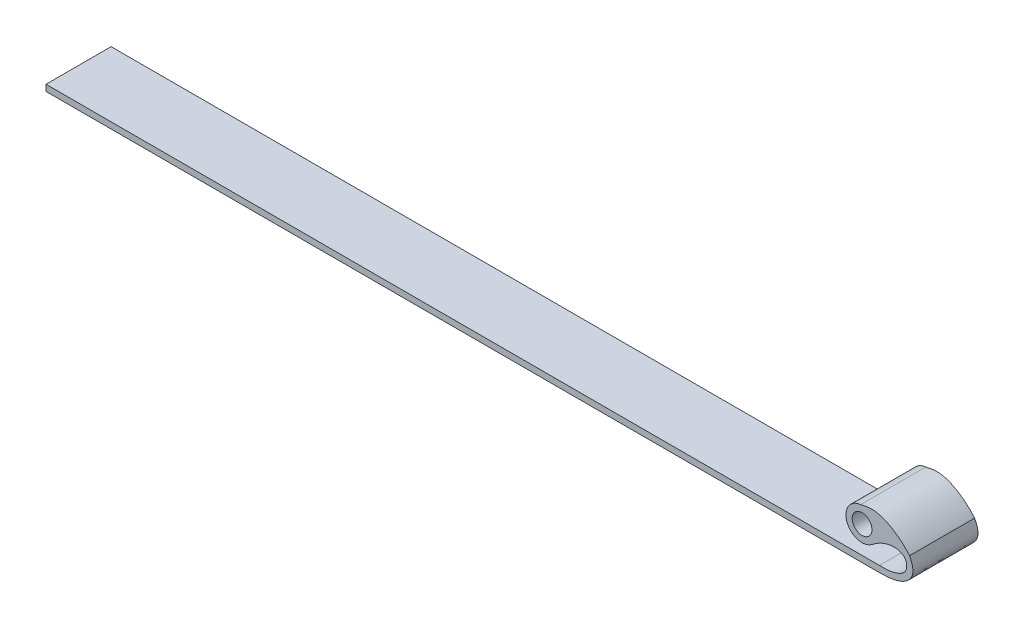
ISO-10303-21;
HEADER;
FILE_DESCRIPTION(('STEP AP214'),'2;1');
FILE_NAME('part.step','',(''),(''),'','','');
FILE_SCHEMA(('AUTOMOTIVE_DESIGN { 1 0 10303 214 1 1 1 1 }'));
ENDSEC;
DATA;
#1=APPLICATION_CONTEXT('core data for automotive mechanical design processes');
#2=APPLICATION_PROTOCOL_DEFINITION('international standard','automotive_design',2000,#1);
#3=PRODUCT_CONTEXT('',#1,'mechanical');
#4=PRODUCT('Part','Part','',(#3));
#5=PRODUCT_RELATED_PRODUCT_CATEGORY('part','',(#4));
#6=PRODUCT_DEFINITION_FORMATION('','',#4);
#7=PRODUCT_DEFINITION_CONTEXT('part definition',#1,'design');
#8=PRODUCT_DEFINITION('design','',#6,#7);
#9=PRODUCT_DEFINITION_SHAPE('','',#8);
#10=(LENGTH_UNIT() NAMED_UNIT(*) SI_UNIT(.MILLI.,.METRE.));
#11=(NAMED_UNIT(*) PLANE_ANGLE_UNIT() SI_UNIT($,.RADIAN.));
#12=(NAMED_UNIT(*) SI_UNIT($,.STERADIAN.) SOLID_ANGLE_UNIT());
#13=UNCERTAINTY_MEASURE_WITH_UNIT(LENGTH_MEASURE(1.E-05),#10,'distance_accuracy_value','');
#14=(GEOMETRIC_REPRESENTATION_CONTEXT(3) GLOBAL_UNCERTAINTY_ASSIGNED_CONTEXT((#13)) GLOBAL_UNIT_ASSIGNED_CONTEXT((#10,
#11,#12)) REPRESENTATION_CONTEXT('',''));
#15=CARTESIAN_POINT('',(0.,0.,0.));
#16=DIRECTION('',(0.,0.,1.));
#17=DIRECTION('',(1.,0.,0.));
#18=AXIS2_PLACEMENT_3D('',#15,#16,#17);
#19=CARTESIAN_POINT('',(-101.6,1.524,-7.9375));
#20=DIRECTION('',(0.,0.,1.));
#21=DIRECTION('',(1.,0.,0.));
#22=AXIS2_PLACEMENT_3D('',#19,#20,#21);
#23=PLANE('',#22);
#24=DIRECTION('',(-1.,0.,0.));
#25=VECTOR('',#24,1.);
#26=CARTESIAN_POINT('',(-101.6,0.,-7.9375));
#27=LINE('',#26,#25);
#28=CARTESIAN_POINT('',(101.6,0.,-7.9375));
#29=VERTEX_POINT('',#28);
#30=CARTESIAN_POINT('',(-101.6,0.,-7.9375));
#31=VERTEX_POINT('',#30);
#32=EDGE_CURVE('E417',#29,#31,#27,.T.);
#33=ORIENTED_EDGE('',*,*,#32,.T.);
#34=DIRECTION('',(0.,-1.,0.));
#35=VECTOR('',#34,1.);
#36=CARTESIAN_POINT('',(-101.6,1.524,-7.9375));
#37=LINE('',#36,#35);
#38=CARTESIAN_POINT('',(-101.6,1.524,-7.9375));
#39=VERTEX_POINT('',#38);
#40=EDGE_CURVE('E13',#39,#31,#37,.T.);
#41=ORIENTED_EDGE('',*,*,#40,.F.);
#42=DIRECTION('',(-1.,0.,0.));
#43=VECTOR('',#42,1.);
#44=CARTESIAN_POINT('',(-101.6,1.524,-7.9375));
#45=LINE('',#44,#43);
#46=CARTESIAN_POINT('',(101.6,1.524,-7.9375));
#47=VERTEX_POINT('',#46);
#48=EDGE_CURVE('E105',#47,#39,#45,.T.);
#49=ORIENTED_EDGE('',*,*,#48,.F.);
#50=CARTESIAN_POINT('',(101.6,1.524,-7.9375));
#51=CARTESIAN_POINT('',(103.2581145174,1.44830625060845,-7.9375));
#52=CARTESIAN_POINT('',(104.638933258889,1.5839468313811,-7.9375));
#53=CARTESIAN_POINT('',(105.766741539468,1.88115494749835,-7.9375));
#54=CARTESIAN_POINT('',(106.652889555584,2.29799250736466,-7.9375));
#55=CARTESIAN_POINT('',(107.304535030096,2.79229628595163,-7.9375));
#56=B_SPLINE_CURVE_WITH_KNOTS('',5,(#50,#51,#52,#53,#54,#55),.UNSPECIFIED.,.F.,.F.,(6,6),(0.,
1.),.UNSPECIFIED.);
#57=CARTESIAN_POINT('',(107.304535030096,2.79229628595163,-7.9375));
#58=VERTEX_POINT('',#57);
#59=EDGE_CURVE('E152',#47,#58,#56,.T.);
#60=ORIENTED_EDGE('',*,*,#59,.T.);
#61=CARTESIAN_POINT('',(105.84624026054,4.71478045105846,-7.9375));
#62=DIRECTION('',(0.,0.,1.));
#63=DIRECTION('',(1.,0.,0.));
#64=AXIS2_PLACEMENT_3D('',#61,#62,#63);
#65=CIRCLE('',#64,2.41299999999999);
#66=CARTESIAN_POINT('',(107.228546137525,6.6926074056864,-7.9375));
#67=VERTEX_POINT('',#66);
#68=EDGE_CURVE('E144',#58,#67,#65,.T.);
#69=ORIENTED_EDGE('',*,*,#68,.T.);
#70=CARTESIAN_POINT('',(107.228546137525,6.69260740568641,-7.9375));
#71=CARTESIAN_POINT('',(106.366027923224,7.18125968031638,-7.9375));
#72=CARTESIAN_POINT('',(105.140033894043,7.42790314041779,-7.9375));
#73=CARTESIAN_POINT('',(103.583408393669,7.28792248516063,-7.9375));
#74=CARTESIAN_POINT('',(101.756786703474,6.57793262541788,-7.9375));
#75=CARTESIAN_POINT('',(99.7863318456045,5.04101505684633,-7.9375));
#76=B_SPLINE_CURVE_WITH_KNOTS('',5,(#70,#71,#72,#73,#74,#75),.UNSPECIFIED.,.F.,.F.,(6,6),(0.,
1.),.UNSPECIFIED.);
#77=CARTESIAN_POINT('',(99.7863318456045,5.04101505684633,-7.9375));
#78=VERTEX_POINT('',#77);
#79=EDGE_CURVE('E149',#67,#78,#76,.T.);
#80=ORIENTED_EDGE('',*,*,#79,.T.);
#81=CARTESIAN_POINT('',(97.3649881124775,8.14537707279204,-7.9375));
#82=DIRECTION('',(0.,0.,1.));
#83=DIRECTION('',(1.,0.,0.));
#84=AXIS2_PLACEMENT_3D('',#81,#82,#83);
#85=CIRCLE('',#84,3.937);
#86=CARTESIAN_POINT('',(96.9956217195011,12.0650119368756,-7.9375));
#87=VERTEX_POINT('',#86);
#88=EDGE_CURVE('E349',#87,#78,#85,.T.);
#89=ORIENTED_EDGE('',*,*,#88,.F.);
#90=CARTESIAN_POINT('',(108.94689031,7.25796652044074,-7.9375));
#91=CARTESIAN_POINT('',(106.455515071137,10.2630081344186,-7.9375));
#92=CARTESIAN_POINT('',(101.235622897515,14.0164041221466,-7.9375));
#93=CARTESIAN_POINT('',(98.5340997550261,12.238404022,-7.9375));
#94=CARTESIAN_POINT('',(96.9956217195011,12.0650119368756,-7.9375));
#95=B_SPLINE_CURVE_WITH_KNOTS('',4,(#90,#91,#92,#93,#94),.UNSPECIFIED.,.F.,.F.,(5,5),(0.,1.),.UNSPECIFIED.);
#96=CARTESIAN_POINT('',(108.94689031,7.25796652044074,-7.9375));
#97=VERTEX_POINT('',#96);
#98=EDGE_CURVE('E339',#97,#87,#95,.T.);
#99=ORIENTED_EDGE('',*,*,#98,.F.);
#100=CARTESIAN_POINT('',(101.6,0.,-7.9375));
#101=CARTESIAN_POINT('',(104.748480566418,-0.00374659124343518,-7.9375));
#102=CARTESIAN_POINT('',(109.050367624,0.25994309898186,-7.9375));
#103=CARTESIAN_POINT('',(110.738003530107,3.23586960295305,-7.9375));
#104=CARTESIAN_POINT('',(109.946934459431,5.04402747878365,-7.9375));
#105=CARTESIAN_POINT('',(108.94689031,7.25796652044074,-7.9375));
#106=B_SPLINE_CURVE_WITH_KNOTS('',5,(#100,#101,#102,#103,#104,#105),.UNSPECIFIED.,.F.,.F.,(6,6),
(0.,1.),.UNSPECIFIED.);
#107=EDGE_CURVE('E329',#29,#97,#106,.T.);
#108=ORIENTED_EDGE('',*,*,#107,.F.);
#109=EDGE_LOOP('',(#33,#41,#49,#60,#69,#80,#89,#99,#108));
#110=FACE_BOUND('',#109,.T.);
#111=CARTESIAN_POINT('',(97.3649881124775,8.14537707279204,-7.9375));
#112=DIRECTION('',(0.,0.,1.));
#113=DIRECTION('',(1.,0.,0.));
#114=AXIS2_PLACEMENT_3D('',#111,#112,#113);
#115=CIRCLE('',#114,2.41299999999999);
#116=CARTESIAN_POINT('',(99.7779881124775,8.14537707279204,-7.9375));
#117=VERTEX_POINT('',#116);
#118=EDGE_CURVE('E168',#117,#117,#115,.T.);
#119=ORIENTED_EDGE('',*,*,#118,.T.);
#120=EDGE_LOOP('',(#119));
#121=FACE_BOUND('',#120,.T.);
#122=ADVANCED_FACE('F52',(#110,#121),#23,.F.);
#123=CARTESIAN_POINT('',(-101.6,1.524,7.9375));
#124=DIRECTION('',(1.,0.,0.));
#125=DIRECTION('',(0.,0.,-1.));
#126=AXIS2_PLACEMENT_3D('',#123,#124,#125);
#127=PLANE('',#126);
#128=DIRECTION('',(0.,0.,1.));
#129=VECTOR('',#128,1.);
#130=CARTESIAN_POINT('',(-101.6,0.,7.9375));
#131=LINE('',#130,#129);
#132=CARTESIAN_POINT('',(-101.6,0.,7.9375));
#133=VERTEX_POINT('',#132);
#134=EDGE_CURVE('E85',#31,#133,#131,.T.);
#135=ORIENTED_EDGE('',*,*,#134,.T.);
#136=DIRECTION('',(0.,-1.,0.));
#137=VECTOR('',#136,1.);
#138=CARTESIAN_POINT('',(-101.6,1.524,7.9375));
#139=LINE('',#138,#137);
#140=CARTESIAN_POINT('',(-101.6,1.524,7.9375));
#141=VERTEX_POINT('',#140);
#142=EDGE_CURVE('E60',#141,#133,#139,.T.);
#143=ORIENTED_EDGE('',*,*,#142,.F.);
#144=DIRECTION('',(0.,0.,1.));
#145=VECTOR('',#144,1.);
#146=CARTESIAN_POINT('',(-101.6,1.524,7.9375));
#147=LINE('',#146,#145);
#148=EDGE_CURVE('E410',#39,#141,#147,.T.);
#149=ORIENTED_EDGE('',*,*,#148,.F.);
#150=ORIENTED_EDGE('',*,*,#40,.T.);
#151=EDGE_LOOP('',(#135,#143,#149,#150));
#152=FACE_BOUND('',#151,.T.);
#153=ADVANCED_FACE('F204',(#152),#127,.F.);
#154=CARTESIAN_POINT('',(-101.6,1.524,7.9375));
#155=DIRECTION('',(0.,0.,-1.));
#156=DIRECTION('',(-1.,0.,0.));
#157=AXIS2_PLACEMENT_3D('',#154,#155,#156);
#158=PLANE('',#157);
#159=DIRECTION('',(1.,0.,0.));
#160=VECTOR('',#159,1.);
#161=CARTESIAN_POINT('',(-101.6,0.,7.9375));
#162=LINE('',#161,#160);
#163=CARTESIAN_POINT('',(101.6,0.,7.9375));
#164=VERTEX_POINT('',#163);
#165=EDGE_CURVE('E95',#133,#164,#162,.T.);
#166=ORIENTED_EDGE('',*,*,#165,.T.);
#167=CARTESIAN_POINT('',(101.6,0.,7.9375));
#168=CARTESIAN_POINT('',(104.748480566418,-0.00374659124343518,7.9375));
#169=CARTESIAN_POINT('',(109.050367624,0.25994309898186,7.9375));
#170=CARTESIAN_POINT('',(110.738003530107,3.23586960295305,7.9375));
#171=CARTESIAN_POINT('',(109.946934459431,5.04402747878365,7.9375));
#172=CARTESIAN_POINT('',(108.94689031,7.25796652044074,7.9375));
#173=B_SPLINE_CURVE_WITH_KNOTS('',5,(#167,#168,#169,#170,#171,#172),.UNSPECIFIED.,.F.,.F.,(6,6),
(0.,1.),.UNSPECIFIED.);
#174=CARTESIAN_POINT('',(108.94689031,7.25796652044074,7.9375));
#175=VERTEX_POINT('',#174);
#176=EDGE_CURVE('E373',#164,#175,#173,.T.);
#177=ORIENTED_EDGE('',*,*,#176,.T.);
#178=CARTESIAN_POINT('',(108.94689031,7.25796652044074,7.9375));
#179=CARTESIAN_POINT('',(106.455515071137,10.2630081344186,7.9375));
#180=CARTESIAN_POINT('',(101.235622897515,14.0164041221466,7.9375));
#181=CARTESIAN_POINT('',(98.5340997550261,12.238404022,7.9375));
#182=CARTESIAN_POINT('',(96.9956217195011,12.0650119368756,7.9375));
#183=B_SPLINE_CURVE_WITH_KNOTS('',4,(#178,#179,#180,#181,#182),.UNSPECIFIED.,.F.,.F.,(5,5),(0.,
1.),.UNSPECIFIED.);
#184=CARTESIAN_POINT('',(96.9956217195011,12.0650119368756,7.9375));
#185=VERTEX_POINT('',#184);
#186=EDGE_CURVE('E381',#175,#185,#183,.T.);
#187=ORIENTED_EDGE('',*,*,#186,.T.);
#188=CARTESIAN_POINT('',(97.3649881124775,8.14537707279204,7.9375));
#189=DIRECTION('',(0.,0.,1.));
#190=DIRECTION('',(1.,0.,0.));
#191=AXIS2_PLACEMENT_3D('',#188,#189,#190);
#192=CIRCLE('',#191,3.937);
#193=CARTESIAN_POINT('',(99.7863318456045,5.04101505684633,7.9375));
#194=VERTEX_POINT('',#193);
#195=EDGE_CURVE('E180',#185,#194,#192,.T.);
#196=ORIENTED_EDGE('',*,*,#195,.T.);
#197=CARTESIAN_POINT('',(107.228546137525,6.69260740568641,7.9375));
#198=CARTESIAN_POINT('',(106.366027923224,7.18125968031638,7.9375));
#199=CARTESIAN_POINT('',(105.140033894043,7.42790314041779,7.9375));
#200=CARTESIAN_POINT('',(103.583408393669,7.28792248516063,7.9375));
#201=CARTESIAN_POINT('',(101.756786703474,6.57793262541788,7.9375));
#202=CARTESIAN_POINT('',(99.7863318456045,5.04101505684633,7.9375));
#203=B_SPLINE_CURVE_WITH_KNOTS('',5,(#197,#198,#199,#200,#201,#202),.UNSPECIFIED.,.F.,.F.,(6,6),
(0.,1.),.UNSPECIFIED.);
#204=CARTESIAN_POINT('',(107.228546137525,6.6926074056864,7.9375));
#205=VERTEX_POINT('',#204);
#206=EDGE_CURVE('E358',#205,#194,#203,.T.);
#207=ORIENTED_EDGE('',*,*,#206,.F.);
#208=CARTESIAN_POINT('',(105.84624026054,4.71478045105846,7.9375));
#209=DIRECTION('',(0.,0.,1.));
#210=DIRECTION('',(1.,0.,0.));
#211=AXIS2_PLACEMENT_3D('',#208,#209,#210);
#212=CIRCLE('',#211,2.41299999999999);
#213=CARTESIAN_POINT('',(107.304535030096,2.79229628595163,7.9375));
#214=VERTEX_POINT('',#213);
#215=EDGE_CURVE('E162',#214,#205,#212,.T.);
#216=ORIENTED_EDGE('',*,*,#215,.F.);
#217=CARTESIAN_POINT('',(101.6,1.524,7.9375));
#218=CARTESIAN_POINT('',(103.2581145174,1.44830625060845,7.9375));
#219=CARTESIAN_POINT('',(104.638933258889,1.5839468313811,7.9375));
#220=CARTESIAN_POINT('',(105.766741539468,1.88115494749835,7.9375));
#221=CARTESIAN_POINT('',(106.652889555584,2.29799250736466,7.9375));
#222=CARTESIAN_POINT('',(107.304535030096,2.79229628595163,7.9375));
#223=B_SPLINE_CURVE_WITH_KNOTS('',5,(#217,#218,#219,#220,#221,#222),.UNSPECIFIED.,.F.,.F.,(6,6),
(0.,1.),.UNSPECIFIED.);
#224=CARTESIAN_POINT('',(101.6,1.524,7.9375));
#225=VERTEX_POINT('',#224);
#226=EDGE_CURVE('E368',#225,#214,#223,.T.);
#227=ORIENTED_EDGE('',*,*,#226,.F.);
#228=DIRECTION('',(1.,0.,0.));
#229=VECTOR('',#228,1.);
#230=CARTESIAN_POINT('',(-101.6,1.524,7.9375));
#231=LINE('',#230,#229);
#232=EDGE_CURVE('E71',#141,#225,#231,.T.);
#233=ORIENTED_EDGE('',*,*,#232,.F.);
#234=ORIENTED_EDGE('',*,*,#142,.T.);
#235=EDGE_LOOP('',(#166,#177,#187,#196,#207,#216,#227,#233,#234));
#236=FACE_BOUND('',#235,.T.);
#237=CARTESIAN_POINT('',(97.3649881124775,8.14537707279204,7.9375));
#238=DIRECTION('',(0.,0.,1.));
#239=DIRECTION('',(1.,0.,0.));
#240=AXIS2_PLACEMENT_3D('',#237,#238,#239);
#241=CIRCLE('',#240,2.41299999999999);
#242=CARTESIAN_POINT('',(99.7779881124775,8.14537707279204,7.9375));
#243=VERTEX_POINT('',#242);
#244=EDGE_CURVE('E174',#243,#243,#241,.T.);
#245=ORIENTED_EDGE('',*,*,#244,.F.);
#246=EDGE_LOOP('',(#245));
#247=FACE_BOUND('',#246,.T.);
#248=ADVANCED_FACE('F199',(#236,#247),#158,.F.);
#249=CARTESIAN_POINT('',(0.,1.524,0.));
#250=DIRECTION('',(0.,-1.,0.));
#251=DIRECTION('',(0.,0.,-1.));
#252=AXIS2_PLACEMENT_3D('',#249,#250,#251);
#253=PLANE('',#252);
#254=DIRECTION('',(0.,0.,-1.));
#255=VECTOR('',#254,1.);
#256=CARTESIAN_POINT('',(101.6,1.524,7.9375));
#257=LINE('',#256,#255);
#258=EDGE_CURVE('E406',#225,#47,#257,.T.);
#259=ORIENTED_EDGE('',*,*,#258,.T.);
#260=ORIENTED_EDGE('',*,*,#48,.T.);
#261=ORIENTED_EDGE('',*,*,#148,.T.);
#262=ORIENTED_EDGE('',*,*,#232,.T.);
#263=EDGE_LOOP('',(#259,#260,#261,#262));
#264=FACE_BOUND('',#263,.T.);
#265=ADVANCED_FACE('F196',(#264),#253,.F.);
#266=CARTESIAN_POINT('',(0.,0.,0.));
#267=DIRECTION('',(0.,-1.,0.));
#268=DIRECTION('',(0.,0.,-1.));
#269=AXIS2_PLACEMENT_3D('',#266,#267,#268);
#270=PLANE('',#269);
#271=DIRECTION('',(0.,0.,-1.));
#272=VECTOR('',#271,1.);
#273=CARTESIAN_POINT('',(101.6,0.,7.9375));
#274=LINE('',#273,#272);
#275=EDGE_CURVE('E397',#164,#29,#274,.T.);
#276=ORIENTED_EDGE('',*,*,#275,.F.);
#277=ORIENTED_EDGE('',*,*,#165,.F.);
#278=ORIENTED_EDGE('',*,*,#134,.F.);
#279=ORIENTED_EDGE('',*,*,#32,.F.);
#280=EDGE_LOOP('',(#276,#277,#278,#279));
#281=FACE_BOUND('',#280,.T.);
#282=ADVANCED_FACE('F194',(#281),#270,.T.);
#283=DIRECTION('',(0.,0.,1.));
#284=VECTOR('',#283,1.);
#285=SURFACE_OF_LINEAR_EXTRUSION('',#76,#284);
#286=ORIENTED_EDGE('',*,*,#206,.T.);
#287=DIRECTION('',(0.,0.,1.));
#288=VECTOR('',#287,1.);
#289=CARTESIAN_POINT('',(99.7863318456045,5.04101505684633,-7.9375));
#290=LINE('',#289,#288);
#291=EDGE_CURVE('E171',#78,#194,#290,.T.);
#292=ORIENTED_EDGE('',*,*,#291,.F.);
#293=ORIENTED_EDGE('',*,*,#79,.F.);
#294=DIRECTION('',(0.,0.,1.));
#295=VECTOR('',#294,1.);
#296=CARTESIAN_POINT('',(107.228546137525,6.6926074056864,-7.9375));
#297=LINE('',#296,#295);
#298=EDGE_CURVE('E159',#67,#205,#297,.T.);
#299=ORIENTED_EDGE('',*,*,#298,.T.);
#300=EDGE_LOOP('',(#286,#292,#293,#299));
#301=FACE_BOUND('',#300,.T.);
#302=ADVANCED_FACE('F170',(#301),#285,.F.);
#303=CARTESIAN_POINT('',(97.3649881124775,8.14537707279204,-7.9375));
#304=DIRECTION('',(0.,0.,1.));
#305=DIRECTION('',(1.,0.,0.));
#306=AXIS2_PLACEMENT_3D('',#303,#304,#305);
#307=CYLINDRICAL_SURFACE('',#306,3.937);
#308=ORIENTED_EDGE('',*,*,#195,.F.);
#309=DIRECTION('',(0.,0.,1.));
#310=VECTOR('',#309,1.);
#311=CARTESIAN_POINT('',(96.9956217195011,12.0650119368756,-7.9375));
#312=LINE('',#311,#310);
#313=EDGE_CURVE('E398',#87,#185,#312,.T.);
#314=ORIENTED_EDGE('',*,*,#313,.F.);
#315=ORIENTED_EDGE('',*,*,#88,.T.);
#316=ORIENTED_EDGE('',*,*,#291,.T.);
#317=EDGE_LOOP('',(#308,#314,#315,#316));
#318=FACE_BOUND('',#317,.T.);
#319=ADVANCED_FACE('F193',(#318),#307,.T.);
#320=DIRECTION('',(0.,0.,1.));
#321=VECTOR('',#320,1.);
#322=SURFACE_OF_LINEAR_EXTRUSION('',#95,#321);
#323=ORIENTED_EDGE('',*,*,#186,.F.);
#324=DIRECTION('',(0.,0.,1.));
#325=VECTOR('',#324,1.);
#326=CARTESIAN_POINT('',(108.94689031,7.25796652044074,-7.9375));
#327=LINE('',#326,#325);
#328=EDGE_CURVE('E401',#97,#175,#327,.T.);
#329=ORIENTED_EDGE('',*,*,#328,.F.);
#330=ORIENTED_EDGE('',*,*,#98,.T.);
#331=ORIENTED_EDGE('',*,*,#313,.T.);
#332=EDGE_LOOP('',(#323,#329,#330,#331));
#333=FACE_BOUND('',#332,.T.);
#334=ADVANCED_FACE('F235',(#333),#322,.T.);
#335=DIRECTION('',(0.,0.,1.));
#336=VECTOR('',#335,1.);
#337=SURFACE_OF_LINEAR_EXTRUSION('',#106,#336);
#338=ORIENTED_EDGE('',*,*,#176,.F.);
#339=ORIENTED_EDGE('',*,*,#275,.T.);
#340=ORIENTED_EDGE('',*,*,#107,.T.);
#341=ORIENTED_EDGE('',*,*,#328,.T.);
#342=EDGE_LOOP('',(#338,#339,#340,#341));
#343=FACE_BOUND('',#342,.T.);
#344=ADVANCED_FACE('F231',(#343),#337,.T.);
#345=DIRECTION('',(0.,0.,1.));
#346=VECTOR('',#345,1.);
#347=SURFACE_OF_LINEAR_EXTRUSION('',#56,#346);
#348=ORIENTED_EDGE('',*,*,#226,.T.);
#349=DIRECTION('',(0.,0.,1.));
#350=VECTOR('',#349,1.);
#351=CARTESIAN_POINT('',(107.304535030096,2.79229628595163,-7.9375));
#352=LINE('',#351,#350);
#353=EDGE_CURVE('E167',#58,#214,#352,.T.);
#354=ORIENTED_EDGE('',*,*,#353,.F.);
#355=ORIENTED_EDGE('',*,*,#59,.F.);
#356=ORIENTED_EDGE('',*,*,#258,.F.);
#357=EDGE_LOOP('',(#348,#354,#355,#356));
#358=FACE_BOUND('',#357,.T.);
#359=ADVANCED_FACE('F223',(#358),#347,.F.);
#360=CARTESIAN_POINT('',(105.84624026054,4.71478045105846,-7.9375));
#361=DIRECTION('',(0.,0.,1.));
#362=DIRECTION('',(1.,0.,0.));
#363=AXIS2_PLACEMENT_3D('',#360,#361,#362);
#364=CYLINDRICAL_SURFACE('',#363,2.41299999999999);
#365=ORIENTED_EDGE('',*,*,#215,.T.);
#366=ORIENTED_EDGE('',*,*,#298,.F.);
#367=ORIENTED_EDGE('',*,*,#68,.F.);
#368=ORIENTED_EDGE('',*,*,#353,.T.);
#369=EDGE_LOOP('',(#365,#366,#367,#368));
#370=FACE_BOUND('',#369,.T.);
#371=ADVANCED_FACE('F160',(#370),#364,.F.);
#372=CARTESIAN_POINT('',(97.3649881124775,8.14537707279204,-7.9375));
#373=DIRECTION('',(0.,0.,1.));
#374=DIRECTION('',(1.,0.,0.));
#375=AXIS2_PLACEMENT_3D('',#372,#373,#374);
#376=CYLINDRICAL_SURFACE('',#375,2.41299999999999);
#377=ORIENTED_EDGE('',*,*,#118,.F.);
#378=EDGE_LOOP('',(#377));
#379=FACE_BOUND('',#378,.T.);
#380=ORIENTED_EDGE('',*,*,#244,.T.);
#381=EDGE_LOOP('',(#380));
#382=FACE_BOUND('',#381,.T.);
#383=ADVANCED_FACE('F222',(#379,#382),#376,.F.);
#384=CLOSED_SHELL('',(#122,#153,#248,#265,#282,#302,#319,#334,#344,#359,#371,#383));
#385=MANIFOLD_SOLID_BREP('B2',#384);
#386=ADVANCED_BREP_SHAPE_REPRESENTATION('',(#18,#385),#14);
#387=SHAPE_DEFINITION_REPRESENTATION(#9,#386);
ENDSEC;
END-ISO-10303-21;
